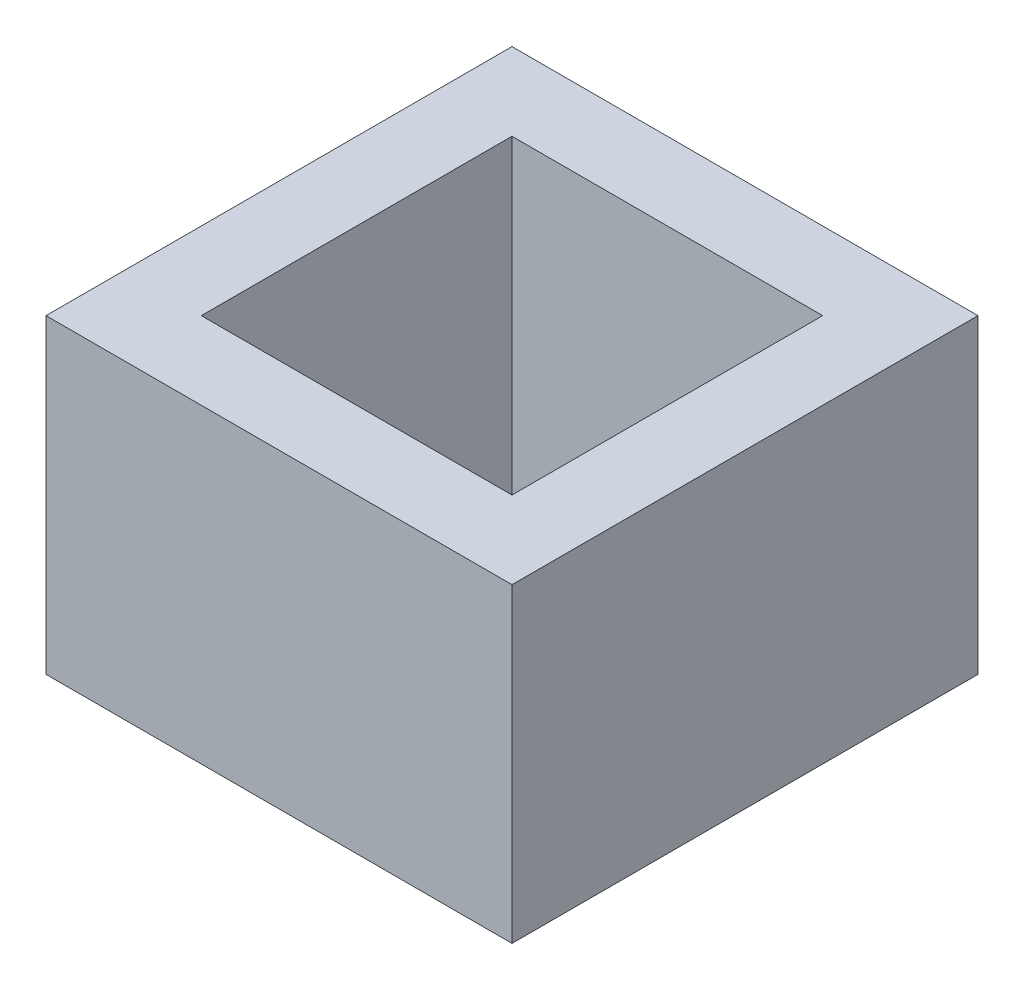
ISO-10303-21;
HEADER;
FILE_DESCRIPTION(('STEP AP214'),'2;1');
FILE_NAME('part.step','',(''),(''),'','','');
FILE_SCHEMA(('AUTOMOTIVE_DESIGN { 1 0 10303 214 1 1 1 1 }'));
ENDSEC;
DATA;
#1=APPLICATION_CONTEXT('core data for automotive mechanical design processes');
#2=APPLICATION_PROTOCOL_DEFINITION('international standard','automotive_design',2000,#1);
#3=PRODUCT_CONTEXT('',#1,'mechanical');
#4=PRODUCT('Part','Part','',(#3));
#5=PRODUCT_RELATED_PRODUCT_CATEGORY('part','',(#4));
#6=PRODUCT_DEFINITION_FORMATION('','',#4);
#7=PRODUCT_DEFINITION_CONTEXT('part definition',#1,'design');
#8=PRODUCT_DEFINITION('design','',#6,#7);
#9=PRODUCT_DEFINITION_SHAPE('','',#8);
#10=(LENGTH_UNIT() NAMED_UNIT(*) SI_UNIT(.MILLI.,.METRE.));
#11=(NAMED_UNIT(*) PLANE_ANGLE_UNIT() SI_UNIT($,.RADIAN.));
#12=(NAMED_UNIT(*) SI_UNIT($,.STERADIAN.) SOLID_ANGLE_UNIT());
#13=UNCERTAINTY_MEASURE_WITH_UNIT(LENGTH_MEASURE(1.E-05),#10,'distance_accuracy_value','');
#14=(GEOMETRIC_REPRESENTATION_CONTEXT(3) GLOBAL_UNCERTAINTY_ASSIGNED_CONTEXT((#13)) GLOBAL_UNIT_ASSIGNED_CONTEXT((#10,
#11,#12)) REPRESENTATION_CONTEXT('',''));
#15=CARTESIAN_POINT('',(0.,0.,0.));
#16=DIRECTION('',(0.,0.,1.));
#17=DIRECTION('',(1.,0.,0.));
#18=AXIS2_PLACEMENT_3D('',#15,#16,#17);
#19=CARTESIAN_POINT('',(0.,20.,0.));
#20=DIRECTION('',(0.,-1.,0.));
#21=DIRECTION('',(0.,0.,-1.));
#22=AXIS2_PLACEMENT_3D('',#19,#20,#21);
#23=PLANE('',#22);
#24=DIRECTION('',(1.,0.,0.));
#25=VECTOR('',#24,1.);
#26=CARTESIAN_POINT('',(15.,20.,15.));
#27=LINE('',#26,#25);
#28=CARTESIAN_POINT('',(-15.,20.,15.));
#29=VERTEX_POINT('',#28);
#30=CARTESIAN_POINT('',(15.,20.,15.));
#31=VERTEX_POINT('',#30);
#32=EDGE_CURVE('E150',#29,#31,#27,.T.);
#33=ORIENTED_EDGE('',*,*,#32,.T.);
#34=DIRECTION('',(0.,0.,-1.));
#35=VECTOR('',#34,1.);
#36=CARTESIAN_POINT('',(15.,20.,15.));
#37=LINE('',#36,#35);
#38=CARTESIAN_POINT('',(15.,20.,-15.));
#39=VERTEX_POINT('',#38);
#40=EDGE_CURVE('E153',#31,#39,#37,.T.);
#41=ORIENTED_EDGE('',*,*,#40,.T.);
#42=DIRECTION('',(-1.,0.,0.));
#43=VECTOR('',#42,1.);
#44=CARTESIAN_POINT('',(15.,20.,-15.));
#45=LINE('',#44,#43);
#46=CARTESIAN_POINT('',(-15.,20.,-15.));
#47=VERTEX_POINT('',#46);
#48=EDGE_CURVE('E156',#39,#47,#45,.T.);
#49=ORIENTED_EDGE('',*,*,#48,.T.);
#50=DIRECTION('',(0.,0.,1.));
#51=VECTOR('',#50,1.);
#52=CARTESIAN_POINT('',(-15.,20.,15.));
#53=LINE('',#52,#51);
#54=EDGE_CURVE('E158',#47,#29,#53,.T.);
#55=ORIENTED_EDGE('',*,*,#54,.T.);
#56=EDGE_LOOP('',(#33,#41,#49,#55));
#57=FACE_BOUND('',#56,.T.);
#58=DIRECTION('',(0.,0.,1.));
#59=VECTOR('',#58,1.);
#60=CARTESIAN_POINT('',(-10.,20.,10.));
#61=LINE('',#60,#59);
#62=CARTESIAN_POINT('',(-10.,20.,-10.));
#63=VERTEX_POINT('',#62);
#64=CARTESIAN_POINT('',(-10.,20.,10.));
#65=VERTEX_POINT('',#64);
#66=EDGE_CURVE('E114',#63,#65,#61,.T.);
#67=ORIENTED_EDGE('',*,*,#66,.F.);
#68=DIRECTION('',(-1.,0.,0.));
#69=VECTOR('',#68,1.);
#70=CARTESIAN_POINT('',(10.,20.,-10.));
#71=LINE('',#70,#69);
#72=CARTESIAN_POINT('',(10.,20.,-10.));
#73=VERTEX_POINT('',#72);
#74=EDGE_CURVE('E136',#73,#63,#71,.T.);
#75=ORIENTED_EDGE('',*,*,#74,.F.);
#76=DIRECTION('',(0.,0.,-1.));
#77=VECTOR('',#76,1.);
#78=CARTESIAN_POINT('',(10.,20.,10.));
#79=LINE('',#78,#77);
#80=CARTESIAN_POINT('',(10.,20.,10.));
#81=VERTEX_POINT('',#80);
#82=EDGE_CURVE('E134',#81,#73,#79,.T.);
#83=ORIENTED_EDGE('',*,*,#82,.F.);
#84=DIRECTION('',(1.,0.,0.));
#85=VECTOR('',#84,1.);
#86=CARTESIAN_POINT('',(10.,20.,10.));
#87=LINE('',#86,#85);
#88=EDGE_CURVE('E122',#65,#81,#87,.T.);
#89=ORIENTED_EDGE('',*,*,#88,.F.);
#90=EDGE_LOOP('',(#67,#75,#83,#89));
#91=FACE_BOUND('',#90,.T.);
#92=ADVANCED_FACE('F49',(#57,#91),#23,.F.);
#93=CARTESIAN_POINT('',(0.,0.,0.));
#94=DIRECTION('',(0.,-1.,0.));
#95=DIRECTION('',(0.,0.,-1.));
#96=AXIS2_PLACEMENT_3D('',#93,#94,#95);
#97=PLANE('',#96);
#98=DIRECTION('',(1.,0.,0.));
#99=VECTOR('',#98,1.);
#100=CARTESIAN_POINT('',(15.,0.,15.));
#101=LINE('',#100,#99);
#102=CARTESIAN_POINT('',(-15.,0.,15.));
#103=VERTEX_POINT('',#102);
#104=CARTESIAN_POINT('',(15.,0.,15.));
#105=VERTEX_POINT('',#104);
#106=EDGE_CURVE('E130',#103,#105,#101,.T.);
#107=ORIENTED_EDGE('',*,*,#106,.F.);
#108=DIRECTION('',(0.,0.,1.));
#109=VECTOR('',#108,1.);
#110=CARTESIAN_POINT('',(-15.,0.,15.));
#111=LINE('',#110,#109);
#112=CARTESIAN_POINT('',(-15.,0.,-15.));
#113=VERTEX_POINT('',#112);
#114=EDGE_CURVE('E154',#113,#103,#111,.T.);
#115=ORIENTED_EDGE('',*,*,#114,.F.);
#116=DIRECTION('',(-1.,0.,0.));
#117=VECTOR('',#116,1.);
#118=CARTESIAN_POINT('',(15.,0.,-15.));
#119=LINE('',#118,#117);
#120=CARTESIAN_POINT('',(15.,0.,-15.));
#121=VERTEX_POINT('',#120);
#122=EDGE_CURVE('E165',#121,#113,#119,.T.);
#123=ORIENTED_EDGE('',*,*,#122,.F.);
#124=DIRECTION('',(0.,0.,-1.));
#125=VECTOR('',#124,1.);
#126=CARTESIAN_POINT('',(15.,0.,15.));
#127=LINE('',#126,#125);
#128=EDGE_CURVE('E163',#105,#121,#127,.T.);
#129=ORIENTED_EDGE('',*,*,#128,.F.);
#130=EDGE_LOOP('',(#107,#115,#123,#129));
#131=FACE_BOUND('',#130,.T.);
#132=DIRECTION('',(-1.,0.,0.));
#133=VECTOR('',#132,1.);
#134=CARTESIAN_POINT('',(10.,0.,-10.));
#135=LINE('',#134,#133);
#136=CARTESIAN_POINT('',(10.,0.,-10.));
#137=VERTEX_POINT('',#136);
#138=CARTESIAN_POINT('',(-10.,0.,-10.));
#139=VERTEX_POINT('',#138);
#140=EDGE_CURVE('E123',#137,#139,#135,.T.);
#141=ORIENTED_EDGE('',*,*,#140,.T.);
#142=DIRECTION('',(0.,0.,1.));
#143=VECTOR('',#142,1.);
#144=CARTESIAN_POINT('',(-10.,0.,10.));
#145=LINE('',#144,#143);
#146=CARTESIAN_POINT('',(-10.,0.,10.));
#147=VERTEX_POINT('',#146);
#148=EDGE_CURVE('E72',#139,#147,#145,.T.);
#149=ORIENTED_EDGE('',*,*,#148,.T.);
#150=DIRECTION('',(1.,0.,0.));
#151=VECTOR('',#150,1.);
#152=CARTESIAN_POINT('',(10.,0.,10.));
#153=LINE('',#152,#151);
#154=CARTESIAN_POINT('',(10.,0.,10.));
#155=VERTEX_POINT('',#154);
#156=EDGE_CURVE('E129',#147,#155,#153,.T.);
#157=ORIENTED_EDGE('',*,*,#156,.T.);
#158=DIRECTION('',(0.,0.,-1.));
#159=VECTOR('',#158,1.);
#160=CARTESIAN_POINT('',(10.,0.,10.));
#161=LINE('',#160,#159);
#162=EDGE_CURVE('E142',#155,#137,#161,.T.);
#163=ORIENTED_EDGE('',*,*,#162,.T.);
#164=EDGE_LOOP('',(#141,#149,#157,#163));
#165=FACE_BOUND('',#164,.T.);
#166=ADVANCED_FACE('F183',(#131,#165),#97,.T.);
#167=CARTESIAN_POINT('',(15.,20.,15.));
#168=DIRECTION('',(0.,0.,-1.));
#169=DIRECTION('',(-1.,0.,0.));
#170=AXIS2_PLACEMENT_3D('',#167,#168,#169);
#171=PLANE('',#170);
#172=ORIENTED_EDGE('',*,*,#106,.T.);
#173=DIRECTION('',(0.,-1.,0.));
#174=VECTOR('',#173,1.);
#175=CARTESIAN_POINT('',(15.,20.,15.));
#176=LINE('',#175,#174);
#177=EDGE_CURVE('E11',#31,#105,#176,.T.);
#178=ORIENTED_EDGE('',*,*,#177,.F.);
#179=ORIENTED_EDGE('',*,*,#32,.F.);
#180=DIRECTION('',(0.,-1.,0.));
#181=VECTOR('',#180,1.);
#182=CARTESIAN_POINT('',(-15.,20.,15.));
#183=LINE('',#182,#181);
#184=EDGE_CURVE('E160',#29,#103,#183,.T.);
#185=ORIENTED_EDGE('',*,*,#184,.T.);
#186=EDGE_LOOP('',(#172,#178,#179,#185));
#187=FACE_BOUND('',#186,.T.);
#188=ADVANCED_FACE('F51',(#187),#171,.F.);
#189=CARTESIAN_POINT('',(15.,20.,15.));
#190=DIRECTION('',(-1.,0.,0.));
#191=DIRECTION('',(0.,0.,1.));
#192=AXIS2_PLACEMENT_3D('',#189,#190,#191);
#193=PLANE('',#192);
#194=ORIENTED_EDGE('',*,*,#128,.T.);
#195=DIRECTION('',(0.,-1.,0.));
#196=VECTOR('',#195,1.);
#197=CARTESIAN_POINT('',(15.,20.,-15.));
#198=LINE('',#197,#196);
#199=EDGE_CURVE('E57',#39,#121,#198,.T.);
#200=ORIENTED_EDGE('',*,*,#199,.F.);
#201=ORIENTED_EDGE('',*,*,#40,.F.);
#202=ORIENTED_EDGE('',*,*,#177,.T.);
#203=EDGE_LOOP('',(#194,#200,#201,#202));
#204=FACE_BOUND('',#203,.T.);
#205=ADVANCED_FACE('F193',(#204),#193,.F.);
#206=CARTESIAN_POINT('',(15.,20.,-15.));
#207=DIRECTION('',(0.,0.,1.));
#208=DIRECTION('',(1.,0.,0.));
#209=AXIS2_PLACEMENT_3D('',#206,#207,#208);
#210=PLANE('',#209);
#211=ORIENTED_EDGE('',*,*,#122,.T.);
#212=DIRECTION('',(0.,-1.,0.));
#213=VECTOR('',#212,1.);
#214=CARTESIAN_POINT('',(-15.,20.,-15.));
#215=LINE('',#214,#213);
#216=EDGE_CURVE('E170',#47,#113,#215,.T.);
#217=ORIENTED_EDGE('',*,*,#216,.F.);
#218=ORIENTED_EDGE('',*,*,#48,.F.);
#219=ORIENTED_EDGE('',*,*,#199,.T.);
#220=EDGE_LOOP('',(#211,#217,#218,#219));
#221=FACE_BOUND('',#220,.T.);
#222=ADVANCED_FACE('F177',(#221),#210,.F.);
#223=CARTESIAN_POINT('',(-15.,20.,15.));
#224=DIRECTION('',(1.,0.,0.));
#225=DIRECTION('',(0.,0.,-1.));
#226=AXIS2_PLACEMENT_3D('',#223,#224,#225);
#227=PLANE('',#226);
#228=ORIENTED_EDGE('',*,*,#114,.T.);
#229=ORIENTED_EDGE('',*,*,#184,.F.);
#230=ORIENTED_EDGE('',*,*,#54,.F.);
#231=ORIENTED_EDGE('',*,*,#216,.T.);
#232=EDGE_LOOP('',(#228,#229,#230,#231));
#233=FACE_BOUND('',#232,.T.);
#234=ADVANCED_FACE('F187',(#233),#227,.F.);
#235=CARTESIAN_POINT('',(-10.,20.,10.));
#236=DIRECTION('',(1.,0.,0.));
#237=DIRECTION('',(0.,0.,-1.));
#238=AXIS2_PLACEMENT_3D('',#235,#236,#237);
#239=PLANE('',#238);
#240=ORIENTED_EDGE('',*,*,#148,.F.);
#241=DIRECTION('',(0.,-1.,0.));
#242=VECTOR('',#241,1.);
#243=CARTESIAN_POINT('',(-10.,20.,-10.));
#244=LINE('',#243,#242);
#245=EDGE_CURVE('E118',#63,#139,#244,.T.);
#246=ORIENTED_EDGE('',*,*,#245,.F.);
#247=ORIENTED_EDGE('',*,*,#66,.T.);
#248=DIRECTION('',(0.,-1.,0.));
#249=VECTOR('',#248,1.);
#250=CARTESIAN_POINT('',(-10.,20.,10.));
#251=LINE('',#250,#249);
#252=EDGE_CURVE('E117',#65,#147,#251,.T.);
#253=ORIENTED_EDGE('',*,*,#252,.T.);
#254=EDGE_LOOP('',(#240,#246,#247,#253));
#255=FACE_BOUND('',#254,.T.);
#256=ADVANCED_FACE('F116',(#255),#239,.T.);
#257=CARTESIAN_POINT('',(10.,20.,10.));
#258=DIRECTION('',(0.,0.,-1.));
#259=DIRECTION('',(-1.,0.,0.));
#260=AXIS2_PLACEMENT_3D('',#257,#258,#259);
#261=PLANE('',#260);
#262=ORIENTED_EDGE('',*,*,#156,.F.);
#263=ORIENTED_EDGE('',*,*,#252,.F.);
#264=ORIENTED_EDGE('',*,*,#88,.T.);
#265=DIRECTION('',(0.,-1.,0.));
#266=VECTOR('',#265,1.);
#267=CARTESIAN_POINT('',(10.,20.,10.));
#268=LINE('',#267,#266);
#269=EDGE_CURVE('E131',#81,#155,#268,.T.);
#270=ORIENTED_EDGE('',*,*,#269,.T.);
#271=EDGE_LOOP('',(#262,#263,#264,#270));
#272=FACE_BOUND('',#271,.T.);
#273=ADVANCED_FACE('F126',(#272),#261,.T.);
#274=CARTESIAN_POINT('',(10.,20.,10.));
#275=DIRECTION('',(-1.,0.,0.));
#276=DIRECTION('',(0.,0.,1.));
#277=AXIS2_PLACEMENT_3D('',#274,#275,#276);
#278=PLANE('',#277);
#279=ORIENTED_EDGE('',*,*,#162,.F.);
#280=ORIENTED_EDGE('',*,*,#269,.F.);
#281=ORIENTED_EDGE('',*,*,#82,.T.);
#282=DIRECTION('',(0.,-1.,0.));
#283=VECTOR('',#282,1.);
#284=CARTESIAN_POINT('',(10.,20.,-10.));
#285=LINE('',#284,#283);
#286=EDGE_CURVE('E64',#73,#137,#285,.T.);
#287=ORIENTED_EDGE('',*,*,#286,.T.);
#288=EDGE_LOOP('',(#279,#280,#281,#287));
#289=FACE_BOUND('',#288,.T.);
#290=ADVANCED_FACE('F216',(#289),#278,.T.);
#291=CARTESIAN_POINT('',(10.,20.,-10.));
#292=DIRECTION('',(0.,0.,1.));
#293=DIRECTION('',(1.,0.,0.));
#294=AXIS2_PLACEMENT_3D('',#291,#292,#293);
#295=PLANE('',#294);
#296=ORIENTED_EDGE('',*,*,#140,.F.);
#297=ORIENTED_EDGE('',*,*,#286,.F.);
#298=ORIENTED_EDGE('',*,*,#74,.T.);
#299=ORIENTED_EDGE('',*,*,#245,.T.);
#300=EDGE_LOOP('',(#296,#297,#298,#299));
#301=FACE_BOUND('',#300,.T.);
#302=ADVANCED_FACE('F220',(#301),#295,.T.);
#303=CLOSED_SHELL('',(#92,#166,#188,#205,#222,#234,#256,#273,#290,#302));
#304=MANIFOLD_SOLID_BREP('B2',#303);
#305=ADVANCED_BREP_SHAPE_REPRESENTATION('',(#18,#304),#14);
#306=SHAPE_DEFINITION_REPRESENTATION(#9,#305);
ENDSEC;
END-ISO-10303-21;
